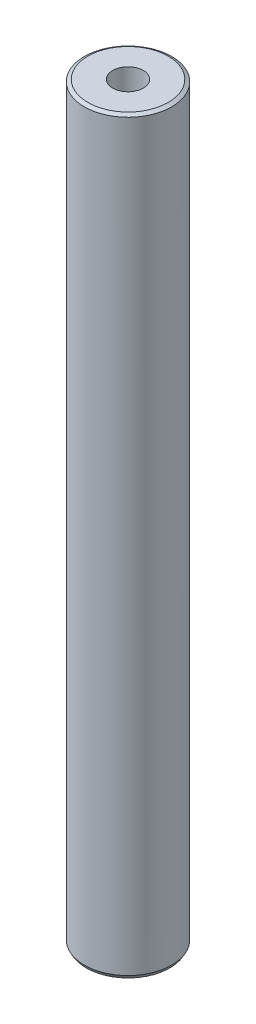
ISO-10303-21;
HEADER;
FILE_DESCRIPTION(('STEP AP214'),'2;1');
FILE_NAME('part.step','',(''),(''),'','','');
FILE_SCHEMA(('AUTOMOTIVE_DESIGN { 1 0 10303 214 1 1 1 1 }'));
ENDSEC;
DATA;
#1=APPLICATION_CONTEXT('core data for automotive mechanical design processes');
#2=APPLICATION_PROTOCOL_DEFINITION('international standard','automotive_design',2000,#1);
#3=PRODUCT_CONTEXT('',#1,'mechanical');
#4=PRODUCT('Part','Part','',(#3));
#5=PRODUCT_RELATED_PRODUCT_CATEGORY('part','',(#4));
#6=PRODUCT_DEFINITION_FORMATION('','',#4);
#7=PRODUCT_DEFINITION_CONTEXT('part definition',#1,'design');
#8=PRODUCT_DEFINITION('design','',#6,#7);
#9=PRODUCT_DEFINITION_SHAPE('','',#8);
#10=(LENGTH_UNIT() NAMED_UNIT(*) SI_UNIT(.MILLI.,.METRE.));
#11=(NAMED_UNIT(*) PLANE_ANGLE_UNIT() SI_UNIT($,.RADIAN.));
#12=(NAMED_UNIT(*) SI_UNIT($,.STERADIAN.) SOLID_ANGLE_UNIT());
#13=UNCERTAINTY_MEASURE_WITH_UNIT(LENGTH_MEASURE(1.E-05),#10,'distance_accuracy_value','');
#14=(GEOMETRIC_REPRESENTATION_CONTEXT(3) GLOBAL_UNCERTAINTY_ASSIGNED_CONTEXT((#13)) GLOBAL_UNIT_ASSIGNED_CONTEXT((#10,
#11,#12)) REPRESENTATION_CONTEXT('',''));
#15=CARTESIAN_POINT('',(0.,0.,0.));
#16=DIRECTION('',(0.,0.,1.));
#17=DIRECTION('',(1.,0.,0.));
#18=AXIS2_PLACEMENT_3D('',#15,#16,#17);
#19=CARTESIAN_POINT('',(0.,600.,0.));
#20=DIRECTION('',(0.,-1.,0.));
#21=DIRECTION('',(0.,0.,-1.));
#22=AXIS2_PLACEMENT_3D('',#19,#20,#21);
#23=CYLINDRICAL_SURFACE('',#22,35.);
#24=CARTESIAN_POINT('',(0.,598.371950982826,0.));
#25=DIRECTION('',(0.,1.,0.));
#26=DIRECTION('',(0.,0.,1.));
#27=AXIS2_PLACEMENT_3D('',#24,#25,#26);
#28=CIRCLE('',#27,35.);
#29=CARTESIAN_POINT('',(0.,598.371950982826,-35.0000000000001));
#30=VERTEX_POINT('',#29);
#31=EDGE_CURVE('E50',#30,#30,#28,.F.);
#32=ORIENTED_EDGE('',*,*,#31,.T.);
#33=EDGE_LOOP('',(#32));
#34=FACE_BOUND('',#33,.T.);
#35=CARTESIAN_POINT('',(0.,2.81986361495801,0.));
#36=DIRECTION('',(0.,1.,0.));
#37=DIRECTION('',(0.,0.,1.));
#38=AXIS2_PLACEMENT_3D('',#35,#36,#37);
#39=CIRCLE('',#38,35.);
#40=CARTESIAN_POINT('',(0.,2.81986361495801,35.));
#41=VERTEX_POINT('',#40);
#42=EDGE_CURVE('E51',#41,#41,#39,.T.);
#43=ORIENTED_EDGE('',*,*,#42,.T.);
#44=EDGE_LOOP('',(#43));
#45=FACE_BOUND('',#44,.T.);
#46=ADVANCED_FACE('F39',(#34,#45),#23,.T.);
#47=CARTESIAN_POINT('',(0.,600.,0.));
#48=DIRECTION('',(0.,1.,0.));
#49=DIRECTION('',(0.,0.,1.));
#50=AXIS2_PLACEMENT_3D('',#47,#48,#49);
#51=PLANE('',#50);
#52=CARTESIAN_POINT('',(0.,600.,0.));
#53=DIRECTION('',(0.,1.,0.));
#54=DIRECTION('',(0.,0.,1.));
#55=AXIS2_PLACEMENT_3D('',#52,#53,#54);
#56=CIRCLE('',#55,32.1801363850421);
#57=CARTESIAN_POINT('',(0.,600.,-32.1801363850422));
#58=VERTEX_POINT('',#57);
#59=EDGE_CURVE('E54',#58,#58,#56,.T.);
#60=ORIENTED_EDGE('',*,*,#59,.T.);
#61=EDGE_LOOP('',(#60));
#62=FACE_BOUND('',#61,.T.);
#63=CARTESIAN_POINT('',(0.,600.,0.));
#64=DIRECTION('',(0.,1.,0.));
#65=DIRECTION('',(0.,0.,1.));
#66=AXIS2_PLACEMENT_3D('',#63,#64,#65);
#67=CIRCLE('',#66,12.2737549561531);
#68=CARTESIAN_POINT('',(0.,600.,12.2737549561531));
#69=VERTEX_POINT('',#68);
#70=EDGE_CURVE('E58',#69,#69,#67,.T.);
#71=ORIENTED_EDGE('',*,*,#70,.F.);
#72=EDGE_LOOP('',(#71));
#73=FACE_BOUND('',#72,.T.);
#74=ADVANCED_FACE('F69',(#62,#73),#51,.T.);
#75=CARTESIAN_POINT('',(0.,0.,0.));
#76=DIRECTION('',(0.,1.,0.));
#77=DIRECTION('',(0.,0.,1.));
#78=AXIS2_PLACEMENT_3D('',#75,#76,#77);
#79=PLANE('',#78);
#80=CARTESIAN_POINT('',(0.,0.,0.));
#81=DIRECTION('',(0.,1.,0.));
#82=DIRECTION('',(0.,0.,1.));
#83=AXIS2_PLACEMENT_3D('',#80,#81,#82);
#84=CIRCLE('',#83,33.371950982826);
#85=CARTESIAN_POINT('',(0.,0.,33.371950982826));
#86=VERTEX_POINT('',#85);
#87=EDGE_CURVE('E10',#86,#86,#84,.F.);
#88=ORIENTED_EDGE('',*,*,#87,.T.);
#89=EDGE_LOOP('',(#88));
#90=FACE_BOUND('',#89,.T.);
#91=CARTESIAN_POINT('',(0.,0.,0.));
#92=DIRECTION('',(0.,1.,0.));
#93=DIRECTION('',(0.,0.,1.));
#94=AXIS2_PLACEMENT_3D('',#91,#92,#93);
#95=CIRCLE('',#94,12.2737549561531);
#96=CARTESIAN_POINT('',(0.,0.,12.2737549561531));
#97=VERTEX_POINT('',#96);
#98=EDGE_CURVE('E63',#97,#97,#95,.T.);
#99=ORIENTED_EDGE('',*,*,#98,.T.);
#100=EDGE_LOOP('',(#99));
#101=FACE_BOUND('',#100,.T.);
#102=ADVANCED_FACE('F75',(#90,#101),#79,.F.);
#103=CARTESIAN_POINT('',(0.,600.,0.));
#104=DIRECTION('',(0.,-1.,0.));
#105=DIRECTION('',(0.,0.,-1.));
#106=AXIS2_PLACEMENT_3D('',#103,#104,#105);
#107=CYLINDRICAL_SURFACE('',#106,12.2737549561531);
#108=ORIENTED_EDGE('',*,*,#70,.T.);
#109=EDGE_LOOP('',(#108));
#110=FACE_BOUND('',#109,.T.);
#111=ORIENTED_EDGE('',*,*,#98,.F.);
#112=EDGE_LOOP('',(#111));
#113=FACE_BOUND('',#112,.T.);
#114=ADVANCED_FACE('F70',(#110,#113),#107,.F.);
#115=CARTESIAN_POINT('',(0.,600.,0.));
#116=DIRECTION('',(0.,-1.,0.));
#117=DIRECTION('',(0.,0.,-1.));
#118=AXIS2_PLACEMENT_3D('',#115,#116,#117);
#119=CONICAL_SURFACE('',#118,32.1801363850421,1.0471975511966);
#120=CARTESIAN_POINT('',(0.,598.371950982826,-35.0000000000001));
#121=CARTESIAN_POINT('',(0.,598.388909826755,-34.9706264206776));
#122=CARTESIAN_POINT('',(0.,598.405868670684,-34.9412528413552));
#123=CARTESIAN_POINT('',(0.,598.439786358542,-34.8825056827102));
#124=CARTESIAN_POINT('',(0.,598.45674520247,-34.8531321033877));
#125=CARTESIAN_POINT('',(0.,598.490662890328,-34.7943849447428));
#126=CARTESIAN_POINT('',(0.,598.507621734257,-34.7650113654203));
#127=CARTESIAN_POINT('',(0.,598.541539422115,-34.7062642067753));
#128=CARTESIAN_POINT('',(0.,598.558498266044,-34.6768906274528));
#129=CARTESIAN_POINT('',(0.,598.592415953902,-34.6181434688079));
#130=CARTESIAN_POINT('',(0.,598.60937479783,-34.5887698894854));
#131=CARTESIAN_POINT('',(0.,598.643292485688,-34.5300227308405));
#132=CARTESIAN_POINT('',(0.,598.660251329617,-34.500649151518));
#133=CARTESIAN_POINT('',(0.,598.694169017475,-34.441901992873));
#134=CARTESIAN_POINT('',(0.,598.711127861404,-34.4125284135505));
#135=CARTESIAN_POINT('',(0.,598.745045549262,-34.3537812549056));
#136=CARTESIAN_POINT('',(0.,598.762004393191,-34.3244076755831));
#137=CARTESIAN_POINT('',(0.,598.795922081048,-34.2656605169382));
#138=CARTESIAN_POINT('',(0.,598.812880924977,-34.2362869376157));
#139=CARTESIAN_POINT('',(0.,598.846798612835,-34.1775397789707));
#140=CARTESIAN_POINT('',(0.,598.863757456764,-34.1481661996483));
#141=CARTESIAN_POINT('',(0.,598.897675144622,-34.0894190410033));
#142=CARTESIAN_POINT('',(0.,598.914633988551,-34.0600454616808));
#143=CARTESIAN_POINT('',(0.,598.948551676408,-34.0012983030359));
#144=CARTESIAN_POINT('',(0.,598.965510520337,-33.9719247237134));
#145=CARTESIAN_POINT('',(0.,598.999428208195,-33.9131775650684));
#146=CARTESIAN_POINT('',(0.,599.016387052124,-33.8838039857459));
#147=CARTESIAN_POINT('',(0.,599.050304739982,-33.825056827101));
#148=CARTESIAN_POINT('',(0.,599.067263583911,-33.7956832477785));
#149=CARTESIAN_POINT('',(0.,599.101181271768,-33.7369360891336));
#150=CARTESIAN_POINT('',(0.,599.118140115697,-33.7075625098111));
#151=CARTESIAN_POINT('',(0.,599.152057803555,-33.6488153511661));
#152=CARTESIAN_POINT('',(0.,599.169016647484,-33.6194417718436));
#153=CARTESIAN_POINT('',(0.,599.202934335342,-33.5606946131987));
#154=CARTESIAN_POINT('',(0.,599.219893179271,-33.5313210338762));
#155=CARTESIAN_POINT('',(0.,599.253810867129,-33.4725738752313));
#156=CARTESIAN_POINT('',(0.,599.270769711057,-33.4432002959088));
#157=CARTESIAN_POINT('',(0.,599.304687398915,-33.3844531372638));
#158=CARTESIAN_POINT('',(0.,599.321646242844,-33.3550795579414));
#159=CARTESIAN_POINT('',(0.,599.355563930702,-33.2963323992964));
#160=CARTESIAN_POINT('',(0.,599.372522774631,-33.2669588199739));
#161=CARTESIAN_POINT('',(0.,599.406440462489,-33.208211661329));
#162=CARTESIAN_POINT('',(0.,599.423399306417,-33.1788380820065));
#163=CARTESIAN_POINT('',(0.,599.457316994275,-33.1200909233615));
#164=CARTESIAN_POINT('',(0.,599.474275838204,-33.090717344039));
#165=CARTESIAN_POINT('',(0.,599.508193526062,-33.0319701853941));
#166=CARTESIAN_POINT('',(0.,599.525152369991,-33.0025966060716));
#167=CARTESIAN_POINT('',(0.,599.559070057849,-32.9438494474267));
#168=CARTESIAN_POINT('',(0.,599.576028901777,-32.9144758681042));
#169=CARTESIAN_POINT('',(0.,599.609946589635,-32.8557287094592));
#170=CARTESIAN_POINT('',(0.,599.626905433564,-32.8263551301367));
#171=CARTESIAN_POINT('',(0.,599.660823121422,-32.7676079714918));
#172=CARTESIAN_POINT('',(0.,599.677781965351,-32.7382343921693));
#173=CARTESIAN_POINT('',(0.,599.711699653209,-32.6794872335243));
#174=CARTESIAN_POINT('',(0.,599.728658497138,-32.6501136542019));
#175=CARTESIAN_POINT('',(0.,599.762576184995,-32.5913664955569));
#176=CARTESIAN_POINT('',(0.,599.779535028924,-32.5619929162344));
#177=CARTESIAN_POINT('',(0.,599.813452716782,-32.5032457575895));
#178=CARTESIAN_POINT('',(0.,599.830411560711,-32.473872178267));
#179=CARTESIAN_POINT('',(0.,599.864329248569,-32.4151250196221));
#180=CARTESIAN_POINT('',(0.,599.881288092498,-32.3857514402996));
#181=CARTESIAN_POINT('',(0.,599.915205780356,-32.3270042816546));
#182=CARTESIAN_POINT('',(0.,599.932164624284,-32.2976307023321));
#183=CARTESIAN_POINT('',(0.,599.966082312142,-32.2388835436872));
#184=CARTESIAN_POINT('',(0.,599.983041156071,-32.2095099643647));
#185=CARTESIAN_POINT('',(0.,600.,-32.1801363850422));
#186=B_SPLINE_CURVE_WITH_KNOTS('',3,(#120,#121,#122,#123,#124,#125,#126,#127,#128,#129,#130,
#131,#132,#133,#134,#135,#136,#137,#138,#139,#140,#141,#142,#143,#144,#145,#146,#147,#148,#149,
#150,#151,#152,#153,#154,#155,#156,#157,#158,#159,#160,#161,#162,#163,#164,#165,#166,#167,#168,
#169,#170,#171,#172,#173,#174,#175,#176,#177,#178,#179,#180,#181,#182,#183,#184,#185),
.UNSPECIFIED.,.F.,.F.,(4,2,2,2,2,2,2,2,2,2,2,2,2,2,2,2,2,2,2,2,2,2,2,2,2,2,2,2,2,2,2,2,4),(0.,
0.101753063573382,0.203506127146763,0.305259190720145,0.407012254293526,0.508765317866902,
0.610518381440284,0.71227144501361,0.814024508586991,0.915777572160373,1.01753063573375,
1.11928369930714,1.22103676288052,1.32278982645384,1.42454289002723,1.52629595360061,
1.62804901717399,1.72980208074736,1.83155514432075,1.93330820789413,2.03506127146745,
2.13681433504083,2.23856739861422,2.3403204621876,2.44207352576098,2.54382658933436,
2.64557965290769,2.74733271648107,2.84908578005445,2.95083884362782,3.05259190720121,
3.15434497077459,3.25609803434797),.UNSPECIFIED.);
#187=EDGE_CURVE('BSEAM81',#30,#58,#186,.T.);
#188=ORIENTED_EDGE('',*,*,#31,.F.);
#189=ORIENTED_EDGE('',*,*,#59,.F.);
#190=ORIENTED_EDGE('',*,*,#187,.T.);
#191=ORIENTED_EDGE('',*,*,#187,.F.);
#192=EDGE_LOOP('',(#188,#190,#189,#191));
#193=FACE_BOUND('',#192,.T.);
#194=ADVANCED_FACE('F81',(#193),#119,.T.);
#195=CARTESIAN_POINT('',(0.,2.81986361495801,0.));
#196=DIRECTION('',(0.,1.,0.));
#197=DIRECTION('',(0.,0.,1.));
#198=AXIS2_PLACEMENT_3D('',#195,#196,#197);
#199=CONICAL_SURFACE('',#198,35.,0.5235987755983);
#200=ORIENTED_EDGE('',*,*,#87,.F.);
#201=EDGE_LOOP('',(#200));
#202=FACE_BOUND('',#201,.T.);
#203=ORIENTED_EDGE('',*,*,#42,.F.);
#204=EDGE_LOOP('',(#203));
#205=FACE_BOUND('',#204,.T.);
#206=ADVANCED_FACE('F45',(#202,#205),#199,.T.);
#207=CLOSED_SHELL('',(#46,#74,#102,#114,#194,#206));
#208=MANIFOLD_SOLID_BREP('B2',#207);
#209=ADVANCED_BREP_SHAPE_REPRESENTATION('',(#18,#208),#14);
#210=SHAPE_DEFINITION_REPRESENTATION(#9,#209);
ENDSEC;
END-ISO-10303-21;
